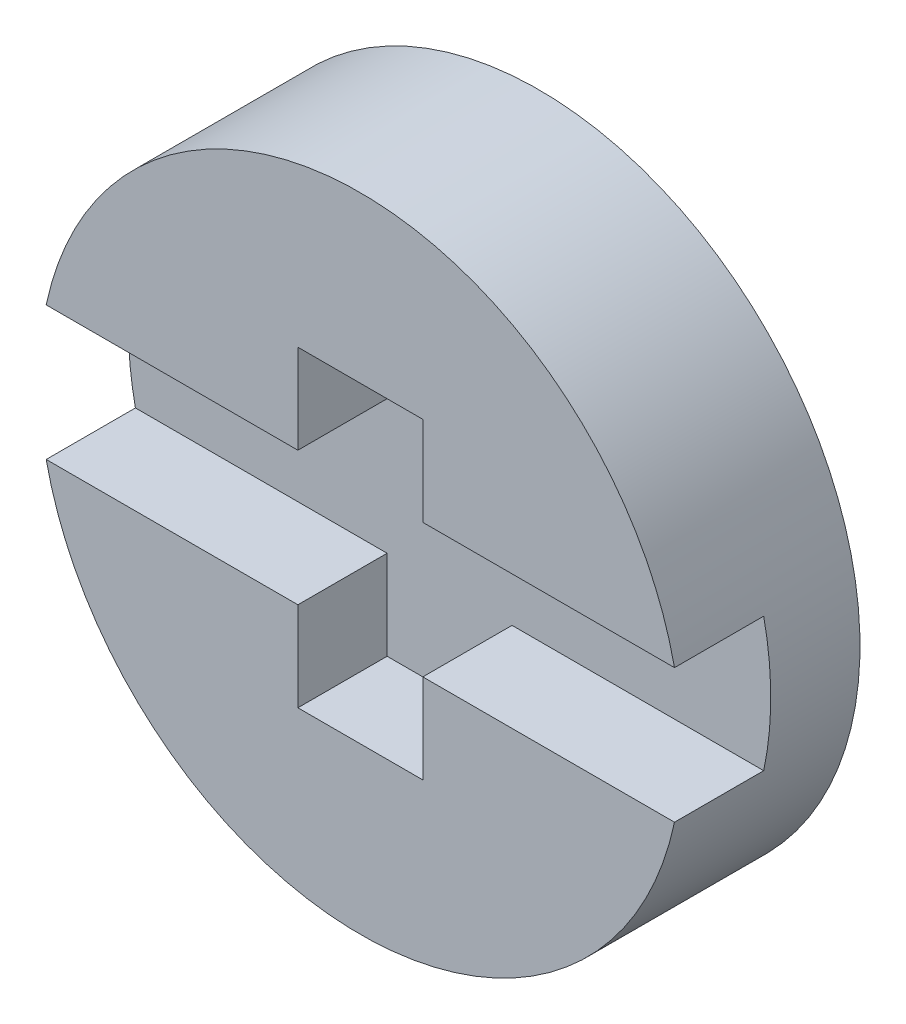
ISO-10303-21;
HEADER;
FILE_DESCRIPTION(('STEP AP214'),'2;1');
FILE_NAME('part.step','',(''),(''),'','','');
FILE_SCHEMA(('AUTOMOTIVE_DESIGN { 1 0 10303 214 1 1 1 1 }'));
ENDSEC;
DATA;
#1=APPLICATION_CONTEXT('core data for automotive mechanical design processes');
#2=APPLICATION_PROTOCOL_DEFINITION('international standard','automotive_design',2000,#1);
#3=PRODUCT_CONTEXT('',#1,'mechanical');
#4=PRODUCT('Part','Part','',(#3));
#5=PRODUCT_RELATED_PRODUCT_CATEGORY('part','',(#4));
#6=PRODUCT_DEFINITION_FORMATION('','',#4);
#7=PRODUCT_DEFINITION_CONTEXT('part definition',#1,'design');
#8=PRODUCT_DEFINITION('design','',#6,#7);
#9=PRODUCT_DEFINITION_SHAPE('','',#8);
#10=(LENGTH_UNIT() NAMED_UNIT(*) SI_UNIT(.MILLI.,.METRE.));
#11=(NAMED_UNIT(*) PLANE_ANGLE_UNIT() SI_UNIT($,.RADIAN.));
#12=(NAMED_UNIT(*) SI_UNIT($,.STERADIAN.) SOLID_ANGLE_UNIT());
#13=UNCERTAINTY_MEASURE_WITH_UNIT(LENGTH_MEASURE(1.E-05),#10,'distance_accuracy_value','');
#14=(GEOMETRIC_REPRESENTATION_CONTEXT(3) GLOBAL_UNCERTAINTY_ASSIGNED_CONTEXT((#13)) GLOBAL_UNIT_ASSIGNED_CONTEXT((#10,
#11,#12)) REPRESENTATION_CONTEXT('',''));
#15=CARTESIAN_POINT('',(0.,0.,0.));
#16=DIRECTION('',(0.,0.,1.));
#17=DIRECTION('',(1.,0.,0.));
#18=AXIS2_PLACEMENT_3D('',#15,#16,#17);
#19=CARTESIAN_POINT('',(9.350063098955,7.50000004212,-29.13542042992));
#20=DIRECTION('',(0.,0.,1.));
#21=DIRECTION('',(1.,0.,0.));
#22=AXIS2_PLACEMENT_3D('',#19,#20,#21);
#23=PLANE('',#22);
#24=DIRECTION('',(1.,0.,0.));
#25=VECTOR('',#24,1.);
#26=CARTESIAN_POINT('',(10.050063098955,6.75000004212,-29.13542042992));
#27=LINE('',#26,#25);
#28=CARTESIAN_POINT('',(10.050063098955,6.75000004212,-29.13542042992));
#29=VERTEX_POINT('',#28);
#30=CARTESIAN_POINT('',(12.8710714772468,6.75000004212,-29.13542042992));
#31=VERTEX_POINT('',#30);
#32=EDGE_CURVE('E87',#29,#31,#27,.T.);
#33=ORIENTED_EDGE('',*,*,#32,.T.);
#34=CARTESIAN_POINT('',(9.350063098955,7.50000004212,-29.13542042992));
#35=DIRECTION('',(0.,0.,-1.));
#36=DIRECTION('',(-1.,0.,0.));
#37=AXIS2_PLACEMENT_3D('',#34,#35,#36);
#38=CIRCLE('',#37,3.6);
#39=CARTESIAN_POINT('',(12.8710714772468,8.25000004212,-29.13542042992));
#40=VERTEX_POINT('',#39);
#41=EDGE_CURVE('E95',#31,#40,#38,.F.);
#42=ORIENTED_EDGE('',*,*,#41,.T.);
#43=DIRECTION('',(1.,0.,0.));
#44=VECTOR('',#43,1.);
#45=CARTESIAN_POINT('',(14.881802433227,8.25000004212,-29.13542042992));
#46=LINE('',#45,#44);
#47=CARTESIAN_POINT('',(10.050063098955,8.25000004212,-29.13542042992));
#48=VERTEX_POINT('',#47);
#49=EDGE_CURVE('E122',#40,#48,#46,.F.);
#50=ORIENTED_EDGE('',*,*,#49,.T.);
#51=DIRECTION('',(0.,1.,0.));
#52=VECTOR('',#51,1.);
#53=CARTESIAN_POINT('',(10.050063098955,8.25000004212,-29.13542042992));
#54=LINE('',#53,#52);
#55=CARTESIAN_POINT('',(10.050063098955,9.25000004212,-29.13542042992));
#56=VERTEX_POINT('',#55);
#57=EDGE_CURVE('E134',#48,#56,#54,.T.);
#58=ORIENTED_EDGE('',*,*,#57,.T.);
#59=DIRECTION('',(1.,0.,0.));
#60=VECTOR('',#59,1.);
#61=CARTESIAN_POINT('',(10.050063098955,9.25000004212,-29.13542042992));
#62=LINE('',#61,#60);
#63=CARTESIAN_POINT('',(8.650063098955,9.25000004212,-29.13542042992));
#64=VERTEX_POINT('',#63);
#65=EDGE_CURVE('E160',#56,#64,#62,.F.);
#66=ORIENTED_EDGE('',*,*,#65,.T.);
#67=DIRECTION('',(0.,1.,0.));
#68=VECTOR('',#67,1.);
#69=CARTESIAN_POINT('',(8.650063098955,9.25000004212,-29.13542042992));
#70=LINE('',#69,#68);
#71=CARTESIAN_POINT('',(8.650063098955,8.25000004212,-29.13542042992));
#72=VERTEX_POINT('',#71);
#73=EDGE_CURVE('E171',#64,#72,#70,.F.);
#74=ORIENTED_EDGE('',*,*,#73,.T.);
#75=DIRECTION('',(1.,0.,0.));
#76=VECTOR('',#75,1.);
#77=CARTESIAN_POINT('',(8.650063098955,8.25000004212,-29.13542042992));
#78=LINE('',#77,#76);
#79=CARTESIAN_POINT('',(5.82905472066317,8.25000004212,-29.13542042992));
#80=VERTEX_POINT('',#79);
#81=EDGE_CURVE('E176',#72,#80,#78,.F.);
#82=ORIENTED_EDGE('',*,*,#81,.T.);
#83=CARTESIAN_POINT('',(9.350063098955,7.50000004212,-29.13542042992));
#84=DIRECTION('',(0.,0.,-1.));
#85=DIRECTION('',(-1.,0.,0.));
#86=AXIS2_PLACEMENT_3D('',#83,#84,#85);
#87=CIRCLE('',#86,3.6);
#88=CARTESIAN_POINT('',(5.82905472066317,6.75000004212,-29.13542042992));
#89=VERTEX_POINT('',#88);
#90=EDGE_CURVE('E19',#80,#89,#87,.F.);
#91=ORIENTED_EDGE('',*,*,#90,.T.);
#92=DIRECTION('',(1.,0.,0.));
#93=VECTOR('',#92,1.);
#94=CARTESIAN_POINT('',(3.028075288359,6.75000004212,-29.13542042992));
#95=LINE('',#94,#93);
#96=CARTESIAN_POINT('',(8.650063098955,6.75000004212,-29.13542042992));
#97=VERTEX_POINT('',#96);
#98=EDGE_CURVE('E180',#89,#97,#95,.T.);
#99=ORIENTED_EDGE('',*,*,#98,.T.);
#100=DIRECTION('',(0.,1.,0.));
#101=VECTOR('',#100,1.);
#102=CARTESIAN_POINT('',(8.650063098955,6.75000004212,-29.13542042992));
#103=LINE('',#102,#101);
#104=CARTESIAN_POINT('',(8.650063098955,5.75000004212,-29.13542042992));
#105=VERTEX_POINT('',#104);
#106=EDGE_CURVE('E195',#97,#105,#103,.F.);
#107=ORIENTED_EDGE('',*,*,#106,.T.);
#108=DIRECTION('',(1.,0.,0.));
#109=VECTOR('',#108,1.);
#110=CARTESIAN_POINT('',(8.650063098955,5.75000004212,-29.13542042992));
#111=LINE('',#110,#109);
#112=CARTESIAN_POINT('',(10.050063098955,5.75000004212,-29.13542042992));
#113=VERTEX_POINT('',#112);
#114=EDGE_CURVE('E73',#105,#113,#111,.T.);
#115=ORIENTED_EDGE('',*,*,#114,.T.);
#116=DIRECTION('',(0.,1.,0.));
#117=VECTOR('',#116,1.);
#118=CARTESIAN_POINT('',(10.050063098955,5.75000004212,-29.13542042992));
#119=LINE('',#118,#117);
#120=EDGE_CURVE('E100',#113,#29,#119,.T.);
#121=ORIENTED_EDGE('',*,*,#120,.T.);
#122=EDGE_LOOP('',(#33,#42,#50,#58,#66,#74,#82,#91,#99,#107,#115,#121));
#123=FACE_BOUND('',#122,.T.);
#124=ADVANCED_FACE('F16',(#123),#23,.T.);
#125=CARTESIAN_POINT('',(10.050063098955,6.75000004212,-28.13542042992));
#126=DIRECTION('',(0.,-1.,0.));
#127=DIRECTION('',(0.,0.,-1.));
#128=AXIS2_PLACEMENT_3D('',#125,#126,#127);
#129=PLANE('',#128);
#130=ORIENTED_EDGE('',*,*,#32,.F.);
#131=DIRECTION('',(0.,0.,-1.));
#132=VECTOR('',#131,1.);
#133=CARTESIAN_POINT('',(10.050063098955,6.75000004212,-28.13542042992));
#134=LINE('',#133,#132);
#135=CARTESIAN_POINT('',(10.050063098955,6.75000004212,-28.13542042992));
#136=VERTEX_POINT('',#135);
#137=EDGE_CURVE('E91',#29,#136,#134,.F.);
#138=ORIENTED_EDGE('',*,*,#137,.T.);
#139=DIRECTION('',(1.,0.,0.));
#140=VECTOR('',#139,1.);
#141=CARTESIAN_POINT('',(9.350063098955,6.75000004212,-28.13542042992));
#142=LINE('',#141,#140);
#143=CARTESIAN_POINT('',(12.8710714772468,6.75000004212,-28.13542042992));
#144=VERTEX_POINT('',#143);
#145=EDGE_CURVE('E141',#144,#136,#142,.F.);
#146=ORIENTED_EDGE('',*,*,#145,.F.);
#147=DIRECTION('',(0.,0.,-1.));
#148=VECTOR('',#147,1.);
#149=CARTESIAN_POINT('',(12.871071477247,6.75000004212,-28.13542042992));
#150=LINE('',#149,#148);
#151=EDGE_CURVE('E93',#31,#144,#150,.F.);
#152=ORIENTED_EDGE('',*,*,#151,.F.);
#153=EDGE_LOOP('',(#130,#138,#146,#152));
#154=FACE_BOUND('',#153,.T.);
#155=ADVANCED_FACE('F89',(#154),#129,.F.);
#156=CARTESIAN_POINT('',(10.050063098955,5.75000004212,-28.13542042992));
#157=DIRECTION('',(1.,0.,0.));
#158=DIRECTION('',(0.,0.,-1.));
#159=AXIS2_PLACEMENT_3D('',#156,#157,#158);
#160=PLANE('',#159);
#161=ORIENTED_EDGE('',*,*,#120,.F.);
#162=DIRECTION('',(0.,0.,-1.));
#163=VECTOR('',#162,1.);
#164=CARTESIAN_POINT('',(10.050063098955,5.75000004212,-28.13542042992));
#165=LINE('',#164,#163);
#166=CARTESIAN_POINT('',(10.050063098955,5.75000004212,-28.13542042992));
#167=VERTEX_POINT('',#166);
#168=EDGE_CURVE('E202',#113,#167,#165,.F.);
#169=ORIENTED_EDGE('',*,*,#168,.T.);
#170=DIRECTION('',(0.,1.,0.));
#171=VECTOR('',#170,1.);
#172=CARTESIAN_POINT('',(10.050063098955,7.50000004212,-28.13542042992));
#173=LINE('',#172,#171);
#174=EDGE_CURVE('E102',#136,#167,#173,.F.);
#175=ORIENTED_EDGE('',*,*,#174,.F.);
#176=ORIENTED_EDGE('',*,*,#137,.F.);
#177=EDGE_LOOP('',(#161,#169,#175,#176));
#178=FACE_BOUND('',#177,.T.);
#179=ADVANCED_FACE('F98',(#178),#160,.F.);
#180=CARTESIAN_POINT('',(8.650063098955,5.75000004212,-28.13542042992));
#181=DIRECTION('',(0.,-1.,0.));
#182=DIRECTION('',(0.,0.,-1.));
#183=AXIS2_PLACEMENT_3D('',#180,#181,#182);
#184=PLANE('',#183);
#185=ORIENTED_EDGE('',*,*,#114,.F.);
#186=DIRECTION('',(0.,0.,1.));
#187=VECTOR('',#186,1.);
#188=CARTESIAN_POINT('',(8.650063098955,5.75000004212,-28.13542042992));
#189=LINE('',#188,#187);
#190=CARTESIAN_POINT('',(8.650063098955,5.75000004212,-28.13542042992));
#191=VERTEX_POINT('',#190);
#192=EDGE_CURVE('E181',#105,#191,#189,.T.);
#193=ORIENTED_EDGE('',*,*,#192,.T.);
#194=DIRECTION('',(1.,0.,0.));
#195=VECTOR('',#194,1.);
#196=CARTESIAN_POINT('',(9.350063098955,5.75000004212,-28.13542042992));
#197=LINE('',#196,#195);
#198=EDGE_CURVE('E191',#167,#191,#197,.F.);
#199=ORIENTED_EDGE('',*,*,#198,.F.);
#200=ORIENTED_EDGE('',*,*,#168,.F.);
#201=EDGE_LOOP('',(#185,#193,#199,#200));
#202=FACE_BOUND('',#201,.T.);
#203=ADVANCED_FACE('F277',(#202),#184,.F.);
#204=CARTESIAN_POINT('',(8.650063098955,6.75000004212,-28.13542042992));
#205=DIRECTION('',(-1.,0.,0.));
#206=DIRECTION('',(0.,0.,1.));
#207=AXIS2_PLACEMENT_3D('',#204,#205,#206);
#208=PLANE('',#207);
#209=ORIENTED_EDGE('',*,*,#106,.F.);
#210=DIRECTION('',(0.,0.,-1.));
#211=VECTOR('',#210,1.);
#212=CARTESIAN_POINT('',(8.650063098955,6.75000004212,-28.13542042992));
#213=LINE('',#212,#211);
#214=CARTESIAN_POINT('',(8.650063098955,6.75000004212,-28.13542042992));
#215=VERTEX_POINT('',#214);
#216=EDGE_CURVE('E182',#97,#215,#213,.F.);
#217=ORIENTED_EDGE('',*,*,#216,.T.);
#218=DIRECTION('',(0.,1.,0.));
#219=VECTOR('',#218,1.);
#220=CARTESIAN_POINT('',(8.650063098955,7.50000004212,-28.13542042992));
#221=LINE('',#220,#219);
#222=EDGE_CURVE('E187',#191,#215,#221,.T.);
#223=ORIENTED_EDGE('',*,*,#222,.F.);
#224=ORIENTED_EDGE('',*,*,#192,.F.);
#225=EDGE_LOOP('',(#209,#217,#223,#224));
#226=FACE_BOUND('',#225,.T.);
#227=ADVANCED_FACE('F279',(#226),#208,.F.);
#228=CARTESIAN_POINT('',(3.028075288359,6.75000004212,-28.13542042992));
#229=DIRECTION('',(0.,-1.,0.));
#230=DIRECTION('',(0.,0.,-1.));
#231=AXIS2_PLACEMENT_3D('',#228,#229,#230);
#232=PLANE('',#231);
#233=ORIENTED_EDGE('',*,*,#98,.F.);
#234=DIRECTION('',(0.,0.,-1.));
#235=VECTOR('',#234,1.);
#236=CARTESIAN_POINT('',(5.829054720663,6.75000004212,-28.13542042992));
#237=LINE('',#236,#235);
#238=CARTESIAN_POINT('',(5.82905472066317,6.75000004212,-28.13542042992));
#239=VERTEX_POINT('',#238);
#240=EDGE_CURVE('E177',#239,#89,#237,.T.);
#241=ORIENTED_EDGE('',*,*,#240,.F.);
#242=DIRECTION('',(1.,0.,0.));
#243=VECTOR('',#242,1.);
#244=CARTESIAN_POINT('',(9.350063098955,6.75000004212,-28.13542042992));
#245=LINE('',#244,#243);
#246=EDGE_CURVE('E190',#215,#239,#245,.F.);
#247=ORIENTED_EDGE('',*,*,#246,.F.);
#248=ORIENTED_EDGE('',*,*,#216,.F.);
#249=EDGE_LOOP('',(#233,#241,#247,#248));
#250=FACE_BOUND('',#249,.T.);
#251=ADVANCED_FACE('F234',(#250),#232,.F.);
#252=CARTESIAN_POINT('',(8.650063098955,8.25000004212,-28.13542042992));
#253=DIRECTION('',(0.,1.,0.));
#254=DIRECTION('',(0.,0.,1.));
#255=AXIS2_PLACEMENT_3D('',#252,#253,#254);
#256=PLANE('',#255);
#257=ORIENTED_EDGE('',*,*,#81,.F.);
#258=DIRECTION('',(0.,0.,1.));
#259=VECTOR('',#258,1.);
#260=CARTESIAN_POINT('',(8.650063098955,8.25000004212,-28.13542042992));
#261=LINE('',#260,#259);
#262=CARTESIAN_POINT('',(8.650063098955,8.25000004212,-28.13542042992));
#263=VERTEX_POINT('',#262);
#264=EDGE_CURVE('E168',#72,#263,#261,.T.);
#265=ORIENTED_EDGE('',*,*,#264,.T.);
#266=DIRECTION('',(1.,0.,0.));
#267=VECTOR('',#266,1.);
#268=CARTESIAN_POINT('',(9.350063098955,8.25000004212,-28.13542042992));
#269=LINE('',#268,#267);
#270=CARTESIAN_POINT('',(5.82905472066317,8.25000004212,-28.13542042992));
#271=VERTEX_POINT('',#270);
#272=EDGE_CURVE('E165',#271,#263,#269,.T.);
#273=ORIENTED_EDGE('',*,*,#272,.F.);
#274=DIRECTION('',(0.,0.,1.));
#275=VECTOR('',#274,1.);
#276=CARTESIAN_POINT('',(5.829054720663,8.25000004212,-28.13542042992));
#277=LINE('',#276,#275);
#278=EDGE_CURVE('E174',#80,#271,#277,.T.);
#279=ORIENTED_EDGE('',*,*,#278,.F.);
#280=EDGE_LOOP('',(#257,#265,#273,#279));
#281=FACE_BOUND('',#280,.T.);
#282=ADVANCED_FACE('F287',(#281),#256,.F.);
#283=CARTESIAN_POINT('',(8.650063098955,9.25000004212,-28.13542042992));
#284=DIRECTION('',(-1.,0.,0.));
#285=DIRECTION('',(0.,0.,1.));
#286=AXIS2_PLACEMENT_3D('',#283,#284,#285);
#287=PLANE('',#286);
#288=ORIENTED_EDGE('',*,*,#73,.F.);
#289=DIRECTION('',(0.,0.,1.));
#290=VECTOR('',#289,1.);
#291=CARTESIAN_POINT('',(8.650063098955,9.25000004212,-28.13542042992));
#292=LINE('',#291,#290);
#293=CARTESIAN_POINT('',(8.650063098955,9.25000004212,-28.13542042992));
#294=VERTEX_POINT('',#293);
#295=EDGE_CURVE('E157',#64,#294,#292,.T.);
#296=ORIENTED_EDGE('',*,*,#295,.T.);
#297=DIRECTION('',(0.,1.,0.));
#298=VECTOR('',#297,1.);
#299=CARTESIAN_POINT('',(8.650063098955,7.50000004212,-28.13542042992));
#300=LINE('',#299,#298);
#301=EDGE_CURVE('E154',#263,#294,#300,.T.);
#302=ORIENTED_EDGE('',*,*,#301,.F.);
#303=ORIENTED_EDGE('',*,*,#264,.F.);
#304=EDGE_LOOP('',(#288,#296,#302,#303));
#305=FACE_BOUND('',#304,.T.);
#306=ADVANCED_FACE('F314',(#305),#287,.F.);
#307=CARTESIAN_POINT('',(10.050063098955,9.25000004212,-28.13542042992));
#308=DIRECTION('',(0.,1.,0.));
#309=DIRECTION('',(0.,0.,1.));
#310=AXIS2_PLACEMENT_3D('',#307,#308,#309);
#311=PLANE('',#310);
#312=ORIENTED_EDGE('',*,*,#65,.F.);
#313=DIRECTION('',(0.,0.,-1.));
#314=VECTOR('',#313,1.);
#315=CARTESIAN_POINT('',(10.050063098955,9.25000004212,-28.13542042992));
#316=LINE('',#315,#314);
#317=CARTESIAN_POINT('',(10.050063098955,9.25000004212,-28.13542042992));
#318=VERTEX_POINT('',#317);
#319=EDGE_CURVE('E131',#56,#318,#316,.F.);
#320=ORIENTED_EDGE('',*,*,#319,.T.);
#321=DIRECTION('',(1.,0.,0.));
#322=VECTOR('',#321,1.);
#323=CARTESIAN_POINT('',(9.350063098955,9.25000004212,-28.13542042992));
#324=LINE('',#323,#322);
#325=EDGE_CURVE('E147',#294,#318,#324,.T.);
#326=ORIENTED_EDGE('',*,*,#325,.F.);
#327=ORIENTED_EDGE('',*,*,#295,.F.);
#328=EDGE_LOOP('',(#312,#320,#326,#327));
#329=FACE_BOUND('',#328,.T.);
#330=ADVANCED_FACE('F310',(#329),#311,.F.);
#331=CARTESIAN_POINT('',(10.050063098955,8.25000004212,-28.13542042992));
#332=DIRECTION('',(1.,0.,0.));
#333=DIRECTION('',(0.,0.,-1.));
#334=AXIS2_PLACEMENT_3D('',#331,#332,#333);
#335=PLANE('',#334);
#336=ORIENTED_EDGE('',*,*,#57,.F.);
#337=DIRECTION('',(0.,0.,1.));
#338=VECTOR('',#337,1.);
#339=CARTESIAN_POINT('',(10.050063098955,8.25000004212,-28.13542042992));
#340=LINE('',#339,#338);
#341=CARTESIAN_POINT('',(10.050063098955,8.25000004212,-28.13542042992));
#342=VERTEX_POINT('',#341);
#343=EDGE_CURVE('E127',#48,#342,#340,.T.);
#344=ORIENTED_EDGE('',*,*,#343,.T.);
#345=DIRECTION('',(0.,1.,0.));
#346=VECTOR('',#345,1.);
#347=CARTESIAN_POINT('',(10.050063098955,7.50000004212,-28.13542042992));
#348=LINE('',#347,#346);
#349=EDGE_CURVE('E144',#318,#342,#348,.F.);
#350=ORIENTED_EDGE('',*,*,#349,.F.);
#351=ORIENTED_EDGE('',*,*,#319,.F.);
#352=EDGE_LOOP('',(#336,#344,#350,#351));
#353=FACE_BOUND('',#352,.T.);
#354=ADVANCED_FACE('F307',(#353),#335,.F.);
#355=CARTESIAN_POINT('',(14.881802433227,8.25000004212,-28.13542042992));
#356=DIRECTION('',(0.,1.,0.));
#357=DIRECTION('',(0.,0.,1.));
#358=AXIS2_PLACEMENT_3D('',#355,#356,#357);
#359=PLANE('',#358);
#360=ORIENTED_EDGE('',*,*,#49,.F.);
#361=DIRECTION('',(0.,0.,1.));
#362=VECTOR('',#361,1.);
#363=CARTESIAN_POINT('',(12.871071477247,8.25000004212,-28.13542042992));
#364=LINE('',#363,#362);
#365=CARTESIAN_POINT('',(12.8710714772468,8.25000004212,-28.13542042992));
#366=VERTEX_POINT('',#365);
#367=EDGE_CURVE('E34',#366,#40,#364,.F.);
#368=ORIENTED_EDGE('',*,*,#367,.F.);
#369=DIRECTION('',(1.,0.,0.));
#370=VECTOR('',#369,1.);
#371=CARTESIAN_POINT('',(9.350063098955,8.25000004212,-28.13542042992));
#372=LINE('',#371,#370);
#373=EDGE_CURVE('E119',#342,#366,#372,.T.);
#374=ORIENTED_EDGE('',*,*,#373,.F.);
#375=ORIENTED_EDGE('',*,*,#343,.F.);
#376=EDGE_LOOP('',(#360,#368,#374,#375));
#377=FACE_BOUND('',#376,.T.);
#378=ADVANCED_FACE('F125',(#377),#359,.F.);
#379=CARTESIAN_POINT('',(9.350063098955,7.50000004212,-28.13542042992));
#380=DIRECTION('',(0.,0.,1.));
#381=DIRECTION('',(1.,0.,0.));
#382=AXIS2_PLACEMENT_3D('',#379,#380,#381);
#383=PLANE('',#382);
#384=ORIENTED_EDGE('',*,*,#246,.T.);
#385=CARTESIAN_POINT('',(9.350063098955,7.50000004212,-28.13542042992));
#386=DIRECTION('',(0.,0.,-1.));
#387=DIRECTION('',(-1.,0.,0.));
#388=AXIS2_PLACEMENT_3D('',#385,#386,#387);
#389=CIRCLE('',#388,3.6);
#390=EDGE_CURVE('E117',#144,#239,#389,.T.);
#391=ORIENTED_EDGE('',*,*,#390,.F.);
#392=ORIENTED_EDGE('',*,*,#145,.T.);
#393=ORIENTED_EDGE('',*,*,#174,.T.);
#394=ORIENTED_EDGE('',*,*,#198,.T.);
#395=ORIENTED_EDGE('',*,*,#222,.T.);
#396=EDGE_LOOP('',(#384,#391,#392,#393,#394,#395));
#397=FACE_BOUND('',#396,.T.);
#398=ADVANCED_FACE('F240',(#397),#383,.T.);
#399=CARTESIAN_POINT('',(9.350063098955,7.50000004212,-28.13542042992));
#400=DIRECTION('',(0.,0.,1.));
#401=DIRECTION('',(1.,0.,0.));
#402=AXIS2_PLACEMENT_3D('',#399,#400,#401);
#403=PLANE('',#402);
#404=ORIENTED_EDGE('',*,*,#373,.T.);
#405=CARTESIAN_POINT('',(9.350063098955,7.50000004212,-28.13542042992));
#406=DIRECTION('',(0.,0.,-1.));
#407=DIRECTION('',(-1.,0.,0.));
#408=AXIS2_PLACEMENT_3D('',#405,#406,#407);
#409=CIRCLE('',#408,3.6);
#410=EDGE_CURVE('E25',#271,#366,#409,.T.);
#411=ORIENTED_EDGE('',*,*,#410,.F.);
#412=ORIENTED_EDGE('',*,*,#272,.T.);
#413=ORIENTED_EDGE('',*,*,#301,.T.);
#414=ORIENTED_EDGE('',*,*,#325,.T.);
#415=ORIENTED_EDGE('',*,*,#349,.T.);
#416=EDGE_LOOP('',(#404,#411,#412,#413,#414,#415));
#417=FACE_BOUND('',#416,.T.);
#418=ADVANCED_FACE('F254',(#417),#403,.T.);
#419=CARTESIAN_POINT('',(9.350063098955,7.50000004212,-30.13542042992));
#420=DIRECTION('',(0.,0.,-1.));
#421=DIRECTION('',(-1.,0.,0.));
#422=AXIS2_PLACEMENT_3D('',#419,#420,#421);
#423=CYLINDRICAL_SURFACE('',#422,3.6);
#424=CARTESIAN_POINT('',(9.350063098955,7.50000004212,-30.13542042992));
#425=DIRECTION('',(0.,0.,-1.));
#426=DIRECTION('',(-1.,0.,0.));
#427=AXIS2_PLACEMENT_3D('',#424,#425,#426);
#428=CIRCLE('',#427,3.6);
#429=CARTESIAN_POINT('',(5.750063098955,7.50000004212,-30.13542042992));
#430=VERTEX_POINT('',#429);
#431=EDGE_CURVE('E11',#430,#430,#428,.F.);
#432=ORIENTED_EDGE('',*,*,#431,.T.);
#433=EDGE_LOOP('',(#432));
#434=FACE_BOUND('',#433,.T.);
#435=ORIENTED_EDGE('',*,*,#367,.T.);
#436=ORIENTED_EDGE('',*,*,#41,.F.);
#437=ORIENTED_EDGE('',*,*,#151,.T.);
#438=ORIENTED_EDGE('',*,*,#390,.T.);
#439=ORIENTED_EDGE('',*,*,#240,.T.);
#440=ORIENTED_EDGE('',*,*,#90,.F.);
#441=ORIENTED_EDGE('',*,*,#278,.T.);
#442=ORIENTED_EDGE('',*,*,#410,.T.);
#443=EDGE_LOOP('',(#435,#436,#437,#438,#439,#440,#441,#442));
#444=FACE_BOUND('',#443,.T.);
#445=ADVANCED_FACE('F129',(#434,#444),#423,.T.);
#446=CARTESIAN_POINT('',(9.350063098955,7.50000004212,-30.13542042992));
#447=DIRECTION('',(0.,0.,1.));
#448=DIRECTION('',(1.,0.,0.));
#449=AXIS2_PLACEMENT_3D('',#446,#447,#448);
#450=PLANE('',#449);
#451=ORIENTED_EDGE('',*,*,#431,.F.);
#452=EDGE_LOOP('',(#451));
#453=FACE_BOUND('',#452,.T.);
#454=ADVANCED_FACE('F290',(#453),#450,.F.);
#455=CLOSED_SHELL('',(#124,#155,#179,#203,#227,#251,#282,#306,#330,#354,#378,#398,#418,#445,#454));
#456=MANIFOLD_SOLID_BREP('B1',#455);
#457=ADVANCED_BREP_SHAPE_REPRESENTATION('',(#18,#456),#14);
#458=SHAPE_DEFINITION_REPRESENTATION(#9,#457);
ENDSEC;
END-ISO-10303-21;
